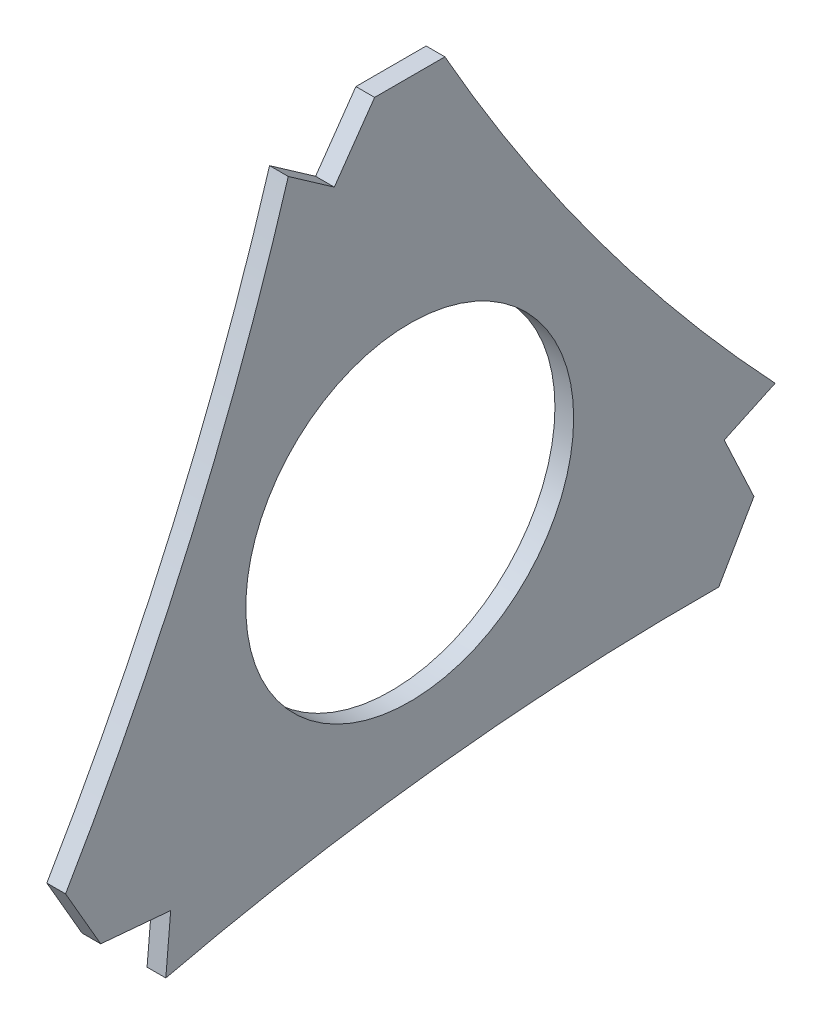
ISO-10303-21;
HEADER;
FILE_DESCRIPTION(('STEP AP214'),'2;1');
FILE_NAME('part.step','',(''),(''),'','','');
FILE_SCHEMA(('AUTOMOTIVE_DESIGN { 1 0 10303 214 1 1 1 1 }'));
ENDSEC;
DATA;
#1=APPLICATION_CONTEXT('core data for automotive mechanical design processes');
#2=APPLICATION_PROTOCOL_DEFINITION('international standard','automotive_design',2000,#1);
#3=PRODUCT_CONTEXT('',#1,'mechanical');
#4=PRODUCT('Part','Part','',(#3));
#5=PRODUCT_RELATED_PRODUCT_CATEGORY('part','',(#4));
#6=PRODUCT_DEFINITION_FORMATION('','',#4);
#7=PRODUCT_DEFINITION_CONTEXT('part definition',#1,'design');
#8=PRODUCT_DEFINITION('design','',#6,#7);
#9=PRODUCT_DEFINITION_SHAPE('','',#8);
#10=(LENGTH_UNIT() NAMED_UNIT(*) SI_UNIT(.MILLI.,.METRE.));
#11=(NAMED_UNIT(*) PLANE_ANGLE_UNIT() SI_UNIT($,.RADIAN.));
#12=(NAMED_UNIT(*) SI_UNIT($,.STERADIAN.) SOLID_ANGLE_UNIT());
#13=UNCERTAINTY_MEASURE_WITH_UNIT(LENGTH_MEASURE(1.E-05),#10,'distance_accuracy_value','');
#14=(GEOMETRIC_REPRESENTATION_CONTEXT(3) GLOBAL_UNCERTAINTY_ASSIGNED_CONTEXT((#13)) GLOBAL_UNIT_ASSIGNED_CONTEXT((#10,
#11,#12)) REPRESENTATION_CONTEXT('',''));
#15=CARTESIAN_POINT('',(0.,0.,0.));
#16=DIRECTION('',(0.,0.,1.));
#17=DIRECTION('',(1.,0.,0.));
#18=AXIS2_PLACEMENT_3D('',#15,#16,#17);
#19=CARTESIAN_POINT('',(21.5,-48.0611215184639,51.0370112481899));
#20=DIRECTION('',(0.,0.996194698091746,-0.0871557427476591));
#21=DIRECTION('',(0.,-0.0871557427476591,-0.996194698091745));
#22=AXIS2_PLACEMENT_3D('',#19,#20,#21);
#23=PLANE('',#22);
#24=DIRECTION('',(1.,0.,0.));
#25=VECTOR('',#24,1.);
#26=CARTESIAN_POINT('',(21.5,-46.753785377249,65.9799317195661));
#27=LINE('',#26,#25);
#28=CARTESIAN_POINT('',(17.5,-46.753785377249,65.9799317195661));
#29=VERTEX_POINT('',#28);
#30=CARTESIAN_POINT('',(21.5,-46.753785377249,65.9799317195661));
#31=VERTEX_POINT('',#30);
#32=EDGE_CURVE('E11',#29,#31,#27,.T.);
#33=ORIENTED_EDGE('',*,*,#32,.F.);
#34=DIRECTION('',(0.,-0.0871557427476591,-0.996194698091745));
#35=VECTOR('',#34,1.);
#36=CARTESIAN_POINT('',(17.5,-48.0611215184639,51.0370112481899));
#37=LINE('',#36,#35);
#38=CARTESIAN_POINT('',(17.5,-48.0611215184639,51.0370112481899));
#39=VERTEX_POINT('',#38);
#40=EDGE_CURVE('E118',#29,#39,#37,.T.);
#41=ORIENTED_EDGE('',*,*,#40,.T.);
#42=DIRECTION('',(1.,0.,0.));
#43=VECTOR('',#42,1.);
#44=CARTESIAN_POINT('',(21.5,-48.0611215184639,51.0370112481899));
#45=LINE('',#44,#43);
#46=CARTESIAN_POINT('',(21.5,-48.0611215184639,51.0370112481899));
#47=VERTEX_POINT('',#46);
#48=EDGE_CURVE('E47',#39,#47,#45,.T.);
#49=ORIENTED_EDGE('',*,*,#48,.T.);
#50=DIRECTION('',(0.,-0.0871557427476591,-0.996194698091745));
#51=VECTOR('',#50,1.);
#52=CARTESIAN_POINT('',(21.5,-48.0611215184639,51.0370112481899));
#53=LINE('',#52,#51);
#54=EDGE_CURVE('E184',#31,#47,#53,.T.);
#55=ORIENTED_EDGE('',*,*,#54,.F.);
#56=EDGE_LOOP('',(#33,#41,#49,#55));
#57=FACE_BOUND('',#56,.T.);
#58=ADVANCED_FACE('F37',(#57),#23,.F.);
#59=CARTESIAN_POINT('',(21.5,-60.0154578955649,52.0828801611618));
#60=DIRECTION('',(0.,-0.0871557427476582,-0.996194698091746));
#61=DIRECTION('',(0.,-0.996194698091746,0.0871557427476582));
#62=AXIS2_PLACEMENT_3D('',#59,#60,#61);
#63=PLANE('',#62);
#64=ORIENTED_EDGE('',*,*,#48,.F.);
#65=DIRECTION('',(0.,-0.996194698091746,0.0871557427476582));
#66=VECTOR('',#65,1.);
#67=CARTESIAN_POINT('',(17.5,-60.0154578955649,52.0828801611618));
#68=LINE('',#67,#66);
#69=CARTESIAN_POINT('',(17.5,-60.0154578955649,52.0828801611618));
#70=VERTEX_POINT('',#69);
#71=EDGE_CURVE('E149',#39,#70,#68,.T.);
#72=ORIENTED_EDGE('',*,*,#71,.T.);
#73=DIRECTION('',(1.,0.,0.));
#74=VECTOR('',#73,1.);
#75=CARTESIAN_POINT('',(21.5,-60.0154578955648,52.0828801611618));
#76=LINE('',#75,#74);
#77=CARTESIAN_POINT('',(21.5,-60.0154578955648,52.0828801611618));
#78=VERTEX_POINT('',#77);
#79=EDGE_CURVE('E177',#70,#78,#76,.T.);
#80=ORIENTED_EDGE('',*,*,#79,.T.);
#81=DIRECTION('',(0.,-0.996194698091746,0.0871557427476582));
#82=VECTOR('',#81,1.);
#83=CARTESIAN_POINT('',(21.5,-60.0154578955649,52.0828801611618));
#84=LINE('',#83,#82);
#85=EDGE_CURVE('E194',#47,#78,#84,.T.);
#86=ORIENTED_EDGE('',*,*,#85,.F.);
#87=EDGE_LOOP('',(#64,#72,#80,#86));
#88=FACE_BOUND('',#87,.T.);
#89=ADVANCED_FACE('F197',(#88),#63,.F.);
#90=CARTESIAN_POINT('',(21.5,-546.74072373853,-62.3658664029449));
#91=DIRECTION('',(-1.,0.,0.));
#92=DIRECTION('',(0.,0.,1.));
#93=AXIS2_PLACEMENT_3D('',#90,#91,#92);
#94=CYLINDRICAL_SURFACE('',#93,500.);
#95=ORIENTED_EDGE('',*,*,#79,.F.);
#96=CARTESIAN_POINT('',(17.5,-546.74072373853,-62.3658664029449));
#97=DIRECTION('',(-1.,0.,0.));
#98=DIRECTION('',(0.,0.,1.));
#99=AXIS2_PLACEMENT_3D('',#96,#97,#98);
#100=CIRCLE('',#99,500.);
#101=CARTESIAN_POINT('',(17.5,-46.7537853772491,-65.9799317195662));
#102=VERTEX_POINT('',#101);
#103=EDGE_CURVE('E146',#70,#102,#100,.T.);
#104=ORIENTED_EDGE('',*,*,#103,.T.);
#105=DIRECTION('',(1.,0.,0.));
#106=VECTOR('',#105,1.);
#107=CARTESIAN_POINT('',(21.5,-46.753785377249,-65.9799317195661));
#108=LINE('',#107,#106);
#109=CARTESIAN_POINT('',(21.5,-46.753785377249,-65.9799317195661));
#110=VERTEX_POINT('',#109);
#111=EDGE_CURVE('E174',#102,#110,#108,.T.);
#112=ORIENTED_EDGE('',*,*,#111,.T.);
#113=CARTESIAN_POINT('',(21.5,-546.74072373853,-62.3658664029449));
#114=DIRECTION('',(-1.,0.,0.));
#115=DIRECTION('',(0.,0.,1.));
#116=AXIS2_PLACEMENT_3D('',#113,#114,#115);
#117=CIRCLE('',#116,500.);
#118=EDGE_CURVE('E198',#78,#110,#117,.T.);
#119=ORIENTED_EDGE('',*,*,#118,.F.);
#120=EDGE_LOOP('',(#95,#104,#112,#119));
#121=FACE_BOUND('',#120,.T.);
#122=ADVANCED_FACE('F242',(#121),#94,.F.);
#123=CARTESIAN_POINT('',(21.5,-33.7634043204824,-73.4799317195661));
#124=DIRECTION('',(0.,0.500000000000001,0.866025403784438));
#125=DIRECTION('',(0.,0.866025403784438,-0.5));
#126=AXIS2_PLACEMENT_3D('',#123,#124,#125);
#127=PLANE('',#126);
#128=ORIENTED_EDGE('',*,*,#111,.F.);
#129=DIRECTION('',(0.,0.866025403784438,-0.5));
#130=VECTOR('',#129,1.);
#131=CARTESIAN_POINT('',(17.5,-33.7634043204824,-73.4799317195661));
#132=LINE('',#131,#130);
#133=CARTESIAN_POINT('',(17.5,-33.7634043204824,-73.4799317195661));
#134=VERTEX_POINT('',#133);
#135=EDGE_CURVE('E143',#102,#134,#132,.T.);
#136=ORIENTED_EDGE('',*,*,#135,.T.);
#137=DIRECTION('',(1.,0.,0.));
#138=VECTOR('',#137,1.);
#139=CARTESIAN_POINT('',(21.5,-33.7634043204824,-73.4799317195661));
#140=LINE('',#139,#138);
#141=CARTESIAN_POINT('',(21.5,-33.7634043204824,-73.4799317195661));
#142=VERTEX_POINT('',#141);
#143=EDGE_CURVE('E171',#134,#142,#140,.T.);
#144=ORIENTED_EDGE('',*,*,#143,.T.);
#145=DIRECTION('',(0.,0.866025403784438,-0.5));
#146=VECTOR('',#145,1.);
#147=CARTESIAN_POINT('',(21.5,-33.7634043204824,-73.4799317195661));
#148=LINE('',#147,#146);
#149=EDGE_CURVE('E200',#110,#142,#148,.T.);
#150=ORIENTED_EDGE('',*,*,#149,.F.);
#151=EDGE_LOOP('',(#128,#136,#144,#150));
#152=FACE_BOUND('',#151,.T.);
#153=ADVANCED_FACE('F275',(#152),#127,.F.);
#154=CARTESIAN_POINT('',(21.5,-20.1687875149326,-67.1406577934556));
#155=DIRECTION('',(0.,-0.422618261740699,0.90630778703665));
#156=DIRECTION('',(0.,0.90630778703665,0.422618261740699));
#157=AXIS2_PLACEMENT_3D('',#154,#155,#156);
#158=PLANE('',#157);
#159=ORIENTED_EDGE('',*,*,#143,.F.);
#160=DIRECTION('',(0.,0.90630778703665,0.422618261740699));
#161=VECTOR('',#160,1.);
#162=CARTESIAN_POINT('',(17.5,-20.1687875149326,-67.1406577934556));
#163=LINE('',#162,#161);
#164=CARTESIAN_POINT('',(17.5,-20.1687875149326,-67.1406577934557));
#165=VERTEX_POINT('',#164);
#166=EDGE_CURVE('E140',#134,#165,#163,.T.);
#167=ORIENTED_EDGE('',*,*,#166,.T.);
#168=DIRECTION('',(1.,0.,0.));
#169=VECTOR('',#168,1.);
#170=CARTESIAN_POINT('',(21.5,-20.1687875149326,-67.1406577934556));
#171=LINE('',#170,#169);
#172=CARTESIAN_POINT('',(21.5,-20.1687875149326,-67.1406577934556));
#173=VERTEX_POINT('',#172);
#174=EDGE_CURVE('E168',#165,#173,#171,.T.);
#175=ORIENTED_EDGE('',*,*,#174,.T.);
#176=DIRECTION('',(0.,0.90630778703665,0.422618261740699));
#177=VECTOR('',#176,1.);
#178=CARTESIAN_POINT('',(21.5,-20.1687875149326,-67.1406577934556));
#179=LINE('',#178,#177);
#180=EDGE_CURVE('E206',#142,#173,#179,.T.);
#181=ORIENTED_EDGE('',*,*,#180,.F.);
#182=EDGE_LOOP('',(#159,#167,#175,#181));
#183=FACE_BOUND('',#182,.T.);
#184=ADVANCED_FACE('F271',(#183),#158,.F.);
#185=CARTESIAN_POINT('',(21.5,-15.0973683740443,-78.0163512378954));
#186=DIRECTION('',(0.,0.906307787036651,0.422618261740698));
#187=DIRECTION('',(0.,0.422618261740698,-0.906307787036651));
#188=AXIS2_PLACEMENT_3D('',#185,#186,#187);
#189=PLANE('',#188);
#190=ORIENTED_EDGE('',*,*,#174,.F.);
#191=DIRECTION('',(0.,0.422618261740698,-0.906307787036651));
#192=VECTOR('',#191,1.);
#193=CARTESIAN_POINT('',(17.5,-15.0973683740443,-78.0163512378954));
#194=LINE('',#193,#192);
#195=CARTESIAN_POINT('',(17.5,-15.0973683740444,-78.0163512378954));
#196=VERTEX_POINT('',#195);
#197=EDGE_CURVE('E137',#165,#196,#194,.T.);
#198=ORIENTED_EDGE('',*,*,#197,.T.);
#199=DIRECTION('',(1.,0.,0.));
#200=VECTOR('',#199,1.);
#201=CARTESIAN_POINT('',(21.5,-15.0973683740445,-78.0163512378956));
#202=LINE('',#201,#200);
#203=CARTESIAN_POINT('',(21.5,-15.0973683740445,-78.0163512378956));
#204=VERTEX_POINT('',#203);
#205=EDGE_CURVE('E165',#196,#204,#202,.T.);
#206=ORIENTED_EDGE('',*,*,#205,.T.);
#207=DIRECTION('',(0.,0.422618261740698,-0.906307787036651));
#208=VECTOR('',#207,1.);
#209=CARTESIAN_POINT('',(21.5,-15.0973683740443,-78.0163512378954));
#210=LINE('',#209,#208);
#211=EDGE_CURVE('E209',#173,#204,#210,.T.);
#212=ORIENTED_EDGE('',*,*,#211,.F.);
#213=EDGE_LOOP('',(#190,#198,#206,#212));
#214=FACE_BOUND('',#213,.T.);
#215=ADVANCED_FACE('F267',(#214),#189,.F.);
#216=CARTESIAN_POINT('',(21.5,327.380786503242,-442.308422839584));
#217=DIRECTION('',(-1.,0.,0.));
#218=DIRECTION('',(0.,0.,1.));
#219=AXIS2_PLACEMENT_3D('',#216,#217,#218);
#220=CYLINDRICAL_SURFACE('',#219,500.);
#221=ORIENTED_EDGE('',*,*,#205,.F.);
#222=CARTESIAN_POINT('',(17.5,327.380786503242,-442.308422839584));
#223=DIRECTION('',(-1.,0.,0.));
#224=DIRECTION('',(0.,0.,1.));
#225=AXIS2_PLACEMENT_3D('',#222,#223,#224);
#226=CIRCLE('',#225,500.);
#227=CARTESIAN_POINT('',(17.5,80.5171896977314,-7.49999999999995));
#228=VERTEX_POINT('',#227);
#229=EDGE_CURVE('E134',#196,#228,#226,.T.);
#230=ORIENTED_EDGE('',*,*,#229,.T.);
#231=DIRECTION('',(1.,0.,0.));
#232=VECTOR('',#231,1.);
#233=CARTESIAN_POINT('',(21.5,80.5171896977314,-7.5));
#234=LINE('',#233,#232);
#235=CARTESIAN_POINT('',(21.5,80.5171896977314,-7.5));
#236=VERTEX_POINT('',#235);
#237=EDGE_CURVE('E162',#228,#236,#234,.T.);
#238=ORIENTED_EDGE('',*,*,#237,.T.);
#239=CARTESIAN_POINT('',(21.5,327.380786503242,-442.308422839584));
#240=DIRECTION('',(-1.,0.,0.));
#241=DIRECTION('',(0.,0.,1.));
#242=AXIS2_PLACEMENT_3D('',#239,#240,#241);
#243=CIRCLE('',#242,500.);
#244=EDGE_CURVE('E212',#204,#236,#243,.T.);
#245=ORIENTED_EDGE('',*,*,#244,.F.);
#246=EDGE_LOOP('',(#221,#230,#238,#245));
#247=FACE_BOUND('',#246,.T.);
#248=ADVANCED_FACE('F263',(#247),#220,.F.);
#249=CARTESIAN_POINT('',(21.5,80.5171896977314,7.5));
#250=DIRECTION('',(0.,-1.,0.));
#251=DIRECTION('',(0.,0.,1.));
#252=AXIS2_PLACEMENT_3D('',#249,#250,#251);
#253=PLANE('',#252);
#254=ORIENTED_EDGE('',*,*,#237,.F.);
#255=DIRECTION('',(0.,0.,1.));
#256=VECTOR('',#255,1.);
#257=CARTESIAN_POINT('',(17.5,80.5171896977314,504.674289242529));
#258=LINE('',#257,#256);
#259=CARTESIAN_POINT('',(17.5,80.5171896977314,7.50000000000001));
#260=VERTEX_POINT('',#259);
#261=EDGE_CURVE('E131',#228,#260,#258,.T.);
#262=ORIENTED_EDGE('',*,*,#261,.T.);
#263=DIRECTION('',(1.,0.,0.));
#264=VECTOR('',#263,1.);
#265=CARTESIAN_POINT('',(21.5,80.5171896977314,7.5));
#266=LINE('',#265,#264);
#267=CARTESIAN_POINT('',(21.5,80.5171896977314,7.5));
#268=VERTEX_POINT('',#267);
#269=EDGE_CURVE('E159',#260,#268,#266,.T.);
#270=ORIENTED_EDGE('',*,*,#269,.T.);
#271=DIRECTION('',(0.,0.,1.));
#272=VECTOR('',#271,1.);
#273=CARTESIAN_POINT('',(21.5,80.5171896977314,7.5));
#274=LINE('',#273,#272);
#275=EDGE_CURVE('E215',#236,#268,#274,.T.);
#276=ORIENTED_EDGE('',*,*,#275,.F.);
#277=EDGE_LOOP('',(#254,#262,#270,#276));
#278=FACE_BOUND('',#277,.T.);
#279=ADVANCED_FACE('F259',(#278),#253,.F.);
#280=CARTESIAN_POINT('',(21.5,68.2299090333966,16.1036465452657));
#281=DIRECTION('',(0.,-0.573576436351047,-0.819152044288991));
#282=DIRECTION('',(0.,-0.819152044288991,0.573576436351047));
#283=AXIS2_PLACEMENT_3D('',#280,#281,#282);
#284=PLANE('',#283);
#285=ORIENTED_EDGE('',*,*,#269,.F.);
#286=DIRECTION('',(0.,-0.819152044288991,0.573576436351047));
#287=VECTOR('',#286,1.);
#288=CARTESIAN_POINT('',(17.5,68.2299090333966,16.1036465452657));
#289=LINE('',#288,#287);
#290=CARTESIAN_POINT('',(17.5,68.2299090333966,16.1036465452657));
#291=VERTEX_POINT('',#290);
#292=EDGE_CURVE('E128',#260,#291,#289,.T.);
#293=ORIENTED_EDGE('',*,*,#292,.T.);
#294=DIRECTION('',(1.,0.,0.));
#295=VECTOR('',#294,1.);
#296=CARTESIAN_POINT('',(21.5,68.2299090333966,16.1036465452657));
#297=LINE('',#296,#295);
#298=CARTESIAN_POINT('',(21.5,68.2299090333966,16.1036465452657));
#299=VERTEX_POINT('',#298);
#300=EDGE_CURVE('E157',#291,#299,#297,.T.);
#301=ORIENTED_EDGE('',*,*,#300,.T.);
#302=DIRECTION('',(0.,-0.819152044288991,0.573576436351047));
#303=VECTOR('',#302,1.);
#304=CARTESIAN_POINT('',(21.5,68.2299090333966,16.1036465452657));
#305=LINE('',#304,#303);
#306=EDGE_CURVE('E218',#268,#299,#305,.T.);
#307=ORIENTED_EDGE('',*,*,#306,.F.);
#308=EDGE_LOOP('',(#285,#293,#301,#307));
#309=FACE_BOUND('',#308,.T.);
#310=ADVANCED_FACE('F254',(#309),#284,.F.);
#311=CARTESIAN_POINT('',(21.5,75.1128262696091,25.9334710767336));
#312=DIRECTION('',(0.,-0.819152044288991,0.573576436351047));
#313=DIRECTION('',(0.,0.573576436351047,0.819152044288991));
#314=AXIS2_PLACEMENT_3D('',#311,#312,#313);
#315=PLANE('',#314);
#316=ORIENTED_EDGE('',*,*,#300,.F.);
#317=DIRECTION('',(0.,0.573576436351047,0.819152044288991));
#318=VECTOR('',#317,1.);
#319=CARTESIAN_POINT('',(17.5,75.1128262696091,25.9334710767336));
#320=LINE('',#319,#318);
#321=CARTESIAN_POINT('',(17.5,75.1128262696092,25.9334710767337));
#322=VERTEX_POINT('',#321);
#323=EDGE_CURVE('E125',#291,#322,#320,.T.);
#324=ORIENTED_EDGE('',*,*,#323,.T.);
#325=DIRECTION('',(1.,0.,0.));
#326=VECTOR('',#325,1.);
#327=CARTESIAN_POINT('',(21.5,75.1128262696091,25.9334710767336));
#328=LINE('',#327,#326);
#329=CARTESIAN_POINT('',(21.5,75.1128262696091,25.9334710767336));
#330=VERTEX_POINT('',#329);
#331=EDGE_CURVE('E55',#322,#330,#328,.T.);
#332=ORIENTED_EDGE('',*,*,#331,.T.);
#333=DIRECTION('',(0.,0.573576436351047,0.819152044288991));
#334=VECTOR('',#333,1.);
#335=CARTESIAN_POINT('',(21.5,75.1128262696091,25.9334710767336));
#336=LINE('',#335,#334);
#337=EDGE_CURVE('E220',#299,#330,#336,.T.);
#338=ORIENTED_EDGE('',*,*,#337,.F.);
#339=EDGE_LOOP('',(#316,#324,#332,#338));
#340=FACE_BOUND('',#339,.T.);
#341=ADVANCED_FACE('F249',(#340),#315,.F.);
#342=CARTESIAN_POINT('',(21.5,219.359937235288,504.674289242529));
#343=DIRECTION('',(-1.,0.,0.));
#344=DIRECTION('',(0.,0.,1.));
#345=AXIS2_PLACEMENT_3D('',#342,#343,#344);
#346=CYLINDRICAL_SURFACE('',#345,500.);
#347=ORIENTED_EDGE('',*,*,#331,.F.);
#348=CARTESIAN_POINT('',(17.5,219.359937235288,504.674289242529));
#349=DIRECTION('',(-1.,0.,0.));
#350=DIRECTION('',(0.,0.,1.));
#351=AXIS2_PLACEMENT_3D('',#348,#349,#350);
#352=CIRCLE('',#351,500.);
#353=CARTESIAN_POINT('',(17.4999999999999,-33.7634043204824,73.4799317195661));
#354=VERTEX_POINT('',#353);
#355=EDGE_CURVE('E116',#322,#354,#352,.T.);
#356=ORIENTED_EDGE('',*,*,#355,.T.);
#357=DIRECTION('',(1.,0.,0.));
#358=VECTOR('',#357,1.);
#359=CARTESIAN_POINT('',(21.5,-33.7634043204824,73.4799317195661));
#360=LINE('',#359,#358);
#361=CARTESIAN_POINT('',(21.5,-33.7634043204824,73.4799317195661));
#362=VERTEX_POINT('',#361);
#363=EDGE_CURVE('E41',#354,#362,#360,.T.);
#364=ORIENTED_EDGE('',*,*,#363,.T.);
#365=CARTESIAN_POINT('',(21.5,219.359937235288,504.674289242529));
#366=DIRECTION('',(-1.,0.,0.));
#367=DIRECTION('',(0.,0.,1.));
#368=AXIS2_PLACEMENT_3D('',#365,#366,#367);
#369=CIRCLE('',#368,500.);
#370=EDGE_CURVE('E155',#330,#362,#369,.T.);
#371=ORIENTED_EDGE('',*,*,#370,.F.);
#372=EDGE_LOOP('',(#347,#356,#364,#371));
#373=FACE_BOUND('',#372,.T.);
#374=ADVANCED_FACE('F120',(#373),#346,.F.);
#375=CARTESIAN_POINT('',(21.5,-46.753785377249,65.9799317195661));
#376=DIRECTION('',(0.,0.500000000000001,-0.866025403784438));
#377=DIRECTION('',(0.,-0.866025403784438,-0.500000000000001));
#378=AXIS2_PLACEMENT_3D('',#375,#376,#377);
#379=PLANE('',#378);
#380=DIRECTION('',(0.,-0.866025403784438,-0.500000000000001));
#381=VECTOR('',#380,1.);
#382=CARTESIAN_POINT('',(17.5,-46.753785377249,65.9799317195661));
#383=LINE('',#382,#381);
#384=EDGE_CURVE('E104',#354,#29,#383,.T.);
#385=ORIENTED_EDGE('',*,*,#384,.T.);
#386=ORIENTED_EDGE('',*,*,#32,.T.);
#387=DIRECTION('',(0.,-0.866025403784438,-0.500000000000001));
#388=VECTOR('',#387,1.);
#389=CARTESIAN_POINT('',(21.5,-46.753785377249,65.9799317195661));
#390=LINE('',#389,#388);
#391=EDGE_CURVE('E106',#362,#31,#390,.T.);
#392=ORIENTED_EDGE('',*,*,#391,.F.);
#393=ORIENTED_EDGE('',*,*,#363,.F.);
#394=EDGE_LOOP('',(#385,#386,#392,#393));
#395=FACE_BOUND('',#394,.T.);
#396=ADVANCED_FACE('F103',(#395),#379,.F.);
#397=CARTESIAN_POINT('',(21.5,0.,0.));
#398=DIRECTION('',(-1.,0.,0.));
#399=DIRECTION('',(0.,0.,1.));
#400=AXIS2_PLACEMENT_3D('',#397,#398,#399);
#401=CYLINDRICAL_SURFACE('',#400,35.);
#402=CARTESIAN_POINT('',(21.5,0.,0.));
#403=DIRECTION('',(1.,0.,0.));
#404=DIRECTION('',(0.,0.,-1.));
#405=AXIS2_PLACEMENT_3D('',#402,#403,#404);
#406=CIRCLE('',#405,35.);
#407=CARTESIAN_POINT('',(21.5,0.,-35.));
#408=VERTEX_POINT('',#407);
#409=EDGE_CURVE('E110',#408,#408,#406,.T.);
#410=ORIENTED_EDGE('',*,*,#409,.T.);
#411=EDGE_LOOP('',(#410));
#412=FACE_BOUND('',#411,.T.);
#413=CARTESIAN_POINT('',(17.5,0.,0.));
#414=DIRECTION('',(1.,0.,0.));
#415=DIRECTION('',(0.,0.,-1.));
#416=AXIS2_PLACEMENT_3D('',#413,#414,#415);
#417=CIRCLE('',#416,35.);
#418=CARTESIAN_POINT('',(17.5,0.,-35.));
#419=VERTEX_POINT('',#418);
#420=EDGE_CURVE('E127',#419,#419,#417,.T.);
#421=ORIENTED_EDGE('',*,*,#420,.F.);
#422=EDGE_LOOP('',(#421));
#423=FACE_BOUND('',#422,.T.);
#424=ADVANCED_FACE('F39',(#412,#423),#401,.F.);
#425=CARTESIAN_POINT('',(21.5,219.359937235288,504.674289242529));
#426=DIRECTION('',(-1.,0.,0.));
#427=DIRECTION('',(0.,0.,1.));
#428=AXIS2_PLACEMENT_3D('',#425,#426,#427);
#429=PLANE('',#428);
#430=ORIENTED_EDGE('',*,*,#370,.T.);
#431=ORIENTED_EDGE('',*,*,#391,.T.);
#432=ORIENTED_EDGE('',*,*,#54,.T.);
#433=ORIENTED_EDGE('',*,*,#85,.T.);
#434=ORIENTED_EDGE('',*,*,#118,.T.);
#435=ORIENTED_EDGE('',*,*,#149,.T.);
#436=ORIENTED_EDGE('',*,*,#180,.T.);
#437=ORIENTED_EDGE('',*,*,#211,.T.);
#438=ORIENTED_EDGE('',*,*,#244,.T.);
#439=ORIENTED_EDGE('',*,*,#275,.T.);
#440=ORIENTED_EDGE('',*,*,#306,.T.);
#441=ORIENTED_EDGE('',*,*,#337,.T.);
#442=EDGE_LOOP('',(#430,#431,#432,#433,#434,#435,#436,#437,#438,#439,#440,#441));
#443=FACE_BOUND('',#442,.T.);
#444=ORIENTED_EDGE('',*,*,#409,.F.);
#445=EDGE_LOOP('',(#444));
#446=FACE_BOUND('',#445,.T.);
#447=ADVANCED_FACE('F191',(#443,#446),#429,.F.);
#448=CARTESIAN_POINT('',(17.5,219.359937235288,504.674289242529));
#449=DIRECTION('',(-1.,0.,0.));
#450=DIRECTION('',(0.,0.,1.));
#451=AXIS2_PLACEMENT_3D('',#448,#449,#450);
#452=PLANE('',#451);
#453=ORIENTED_EDGE('',*,*,#355,.F.);
#454=ORIENTED_EDGE('',*,*,#323,.F.);
#455=ORIENTED_EDGE('',*,*,#292,.F.);
#456=ORIENTED_EDGE('',*,*,#261,.F.);
#457=ORIENTED_EDGE('',*,*,#229,.F.);
#458=ORIENTED_EDGE('',*,*,#197,.F.);
#459=ORIENTED_EDGE('',*,*,#166,.F.);
#460=ORIENTED_EDGE('',*,*,#135,.F.);
#461=ORIENTED_EDGE('',*,*,#103,.F.);
#462=ORIENTED_EDGE('',*,*,#71,.F.);
#463=ORIENTED_EDGE('',*,*,#40,.F.);
#464=ORIENTED_EDGE('',*,*,#384,.F.);
#465=EDGE_LOOP('',(#453,#454,#455,#456,#457,#458,#459,#460,#461,#462,#463,#464));
#466=FACE_BOUND('',#465,.T.);
#467=ORIENTED_EDGE('',*,*,#420,.T.);
#468=EDGE_LOOP('',(#467));
#469=FACE_BOUND('',#468,.T.);
#470=ADVANCED_FACE('F113',(#466,#469),#452,.T.);
#471=CLOSED_SHELL('',(#58,#89,#122,#153,#184,#215,#248,#279,#310,#341,#374,#396,#424,#447,#470));
#472=MANIFOLD_SOLID_BREP('B2',#471);
#473=ADVANCED_BREP_SHAPE_REPRESENTATION('',(#18,#472),#14);
#474=SHAPE_DEFINITION_REPRESENTATION(#9,#473);
ENDSEC;
END-ISO-10303-21;
